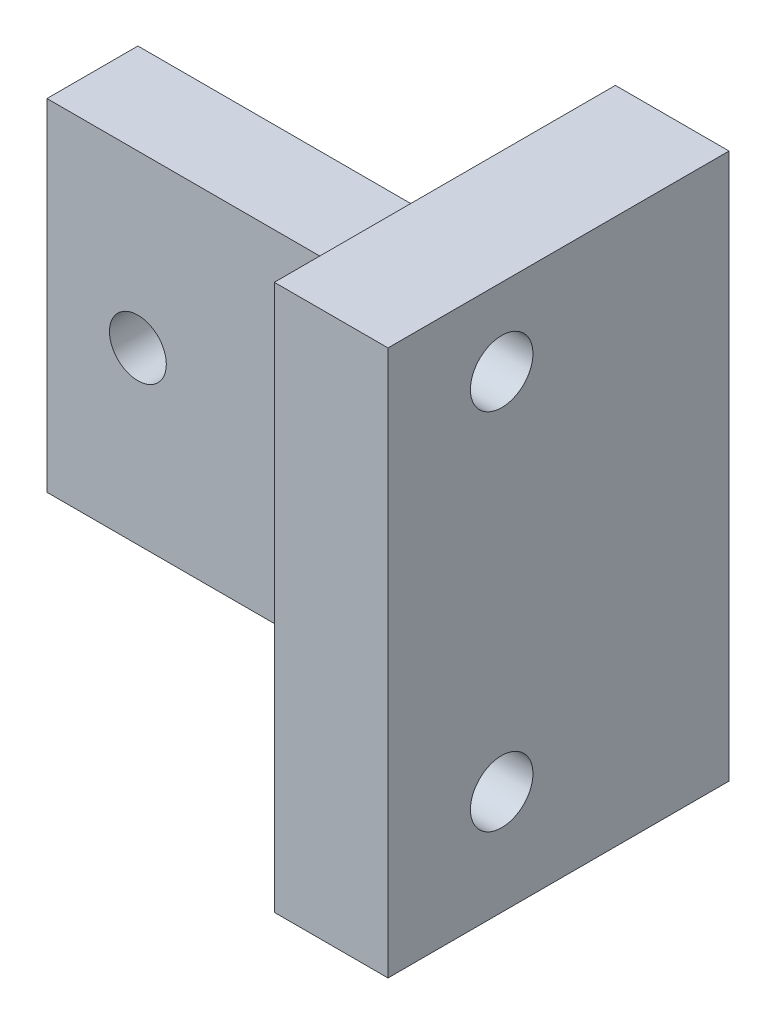
ISO-10303-21;
HEADER;
FILE_DESCRIPTION(('STEP AP214'),'2;1');
FILE_NAME('part.step','',(''),(''),'','','');
FILE_SCHEMA(('AUTOMOTIVE_DESIGN { 1 0 10303 214 1 1 1 1 }'));
ENDSEC;
DATA;
#1=APPLICATION_CONTEXT('core data for automotive mechanical design processes');
#2=APPLICATION_PROTOCOL_DEFINITION('international standard','automotive_design',2000,#1);
#3=PRODUCT_CONTEXT('',#1,'mechanical');
#4=PRODUCT('Part','Part','',(#3));
#5=PRODUCT_RELATED_PRODUCT_CATEGORY('part','',(#4));
#6=PRODUCT_DEFINITION_FORMATION('','',#4);
#7=PRODUCT_DEFINITION_CONTEXT('part definition',#1,'design');
#8=PRODUCT_DEFINITION('design','',#6,#7);
#9=PRODUCT_DEFINITION_SHAPE('','',#8);
#10=(LENGTH_UNIT() NAMED_UNIT(*) SI_UNIT(.MILLI.,.METRE.));
#11=(NAMED_UNIT(*) PLANE_ANGLE_UNIT() SI_UNIT($,.RADIAN.));
#12=(NAMED_UNIT(*) SI_UNIT($,.STERADIAN.) SOLID_ANGLE_UNIT());
#13=UNCERTAINTY_MEASURE_WITH_UNIT(LENGTH_MEASURE(1.E-05),#10,'distance_accuracy_value','');
#14=(GEOMETRIC_REPRESENTATION_CONTEXT(3) GLOBAL_UNCERTAINTY_ASSIGNED_CONTEXT((#13)) GLOBAL_UNIT_ASSIGNED_CONTEXT((#10,
#11,#12)) REPRESENTATION_CONTEXT('',''));
#15=CARTESIAN_POINT('',(0.,0.,0.));
#16=DIRECTION('',(0.,0.,1.));
#17=DIRECTION('',(1.,0.,0.));
#18=AXIS2_PLACEMENT_3D('',#15,#16,#17);
#19=CARTESIAN_POINT('',(0.,0.,0.));
#20=DIRECTION('',(0.,0.,1.));
#21=DIRECTION('',(1.,0.,0.));
#22=AXIS2_PLACEMENT_3D('',#19,#20,#21);
#23=PLANE('',#22);
#24=CARTESIAN_POINT('',(7.99999999999999,15.,0.));
#25=DIRECTION('',(0.,0.,1.));
#26=DIRECTION('',(1.,0.,0.));
#27=AXIS2_PLACEMENT_3D('',#24,#25,#26);
#28=CIRCLE('',#27,2.5);
#29=CARTESIAN_POINT('',(10.5,15.,0.));
#30=VERTEX_POINT('',#29);
#31=EDGE_CURVE('E198',#30,#30,#28,.F.);
#32=ORIENTED_EDGE('',*,*,#31,.F.);
#33=EDGE_LOOP('',(#32));
#34=FACE_BOUND('',#33,.T.);
#35=CARTESIAN_POINT('',(34.,15.,0.));
#36=DIRECTION('',(0.,0.,1.));
#37=DIRECTION('',(1.,0.,0.));
#38=AXIS2_PLACEMENT_3D('',#35,#36,#37);
#39=CIRCLE('',#38,2.5);
#40=CARTESIAN_POINT('',(36.5,15.,0.));
#41=VERTEX_POINT('',#40);
#42=EDGE_CURVE('E167',#41,#41,#39,.F.);
#43=ORIENTED_EDGE('',*,*,#42,.F.);
#44=EDGE_LOOP('',(#43));
#45=FACE_BOUND('',#44,.T.);
#46=DIRECTION('',(0.,1.,0.));
#47=VECTOR('',#46,1.);
#48=CARTESIAN_POINT('',(42.,0.,0.));
#49=LINE('',#48,#47);
#50=CARTESIAN_POINT('',(42.,30.,0.));
#51=VERTEX_POINT('',#50);
#52=CARTESIAN_POINT('',(42.,48.,0.));
#53=VERTEX_POINT('',#52);
#54=EDGE_CURVE('E136',#51,#53,#49,.T.);
#55=ORIENTED_EDGE('',*,*,#54,.T.);
#56=DIRECTION('',(1.,0.,0.));
#57=VECTOR('',#56,1.);
#58=CARTESIAN_POINT('',(0.,48.,0.));
#59=LINE('',#58,#57);
#60=CARTESIAN_POINT('',(52.,48.,0.));
#61=VERTEX_POINT('',#60);
#62=EDGE_CURVE('E125',#53,#61,#59,.T.);
#63=ORIENTED_EDGE('',*,*,#62,.T.);
#64=DIRECTION('',(0.,1.,0.));
#65=VECTOR('',#64,1.);
#66=CARTESIAN_POINT('',(52.,0.,0.));
#67=LINE('',#66,#65);
#68=CARTESIAN_POINT('',(52.,0.,0.));
#69=VERTEX_POINT('',#68);
#70=EDGE_CURVE('E75',#69,#61,#67,.T.);
#71=ORIENTED_EDGE('',*,*,#70,.F.);
#72=DIRECTION('',(1.,0.,0.));
#73=VECTOR('',#72,1.);
#74=CARTESIAN_POINT('',(0.,0.,0.));
#75=LINE('',#74,#73);
#76=CARTESIAN_POINT('',(0.,0.,0.));
#77=VERTEX_POINT('',#76);
#78=EDGE_CURVE('E101',#77,#69,#75,.T.);
#79=ORIENTED_EDGE('',*,*,#78,.F.);
#80=DIRECTION('',(0.,1.,0.));
#81=VECTOR('',#80,1.);
#82=CARTESIAN_POINT('',(0.,0.,0.));
#83=LINE('',#82,#81);
#84=CARTESIAN_POINT('',(0.,30.,0.));
#85=VERTEX_POINT('',#84);
#86=EDGE_CURVE('E164',#77,#85,#83,.T.);
#87=ORIENTED_EDGE('',*,*,#86,.T.);
#88=DIRECTION('',(1.,0.,0.));
#89=VECTOR('',#88,1.);
#90=CARTESIAN_POINT('',(0.,30.,0.));
#91=LINE('',#90,#89);
#92=EDGE_CURVE('E163',#85,#51,#91,.T.);
#93=ORIENTED_EDGE('',*,*,#92,.T.);
#94=EDGE_LOOP('',(#55,#63,#71,#79,#87,#93));
#95=FACE_BOUND('',#94,.T.);
#96=ADVANCED_FACE('F40',(#34,#45,#95),#23,.F.);
#97=CARTESIAN_POINT('',(42.,0.,30.));
#98=DIRECTION('',(-1.,0.,0.));
#99=DIRECTION('',(0.,-1.,0.));
#100=AXIS2_PLACEMENT_3D('',#97,#98,#99);
#101=PLANE('',#100);
#102=DIRECTION('',(0.,0.,1.));
#103=VECTOR('',#102,1.);
#104=CARTESIAN_POINT('',(42.,48.,30.));
#105=LINE('',#104,#103);
#106=CARTESIAN_POINT('',(42.,48.,30.));
#107=VERTEX_POINT('',#106);
#108=EDGE_CURVE('E54',#53,#107,#105,.T.);
#109=ORIENTED_EDGE('',*,*,#108,.F.);
#110=ORIENTED_EDGE('',*,*,#54,.F.);
#111=DIRECTION('',(0.,0.,-1.));
#112=VECTOR('',#111,1.);
#113=CARTESIAN_POINT('',(42.,30.,8.));
#114=LINE('',#113,#112);
#115=CARTESIAN_POINT('',(42.,30.,8.));
#116=VERTEX_POINT('',#115);
#117=EDGE_CURVE('E142',#116,#51,#114,.T.);
#118=ORIENTED_EDGE('',*,*,#117,.F.);
#119=DIRECTION('',(0.,1.,0.));
#120=VECTOR('',#119,1.);
#121=CARTESIAN_POINT('',(42.,0.,8.));
#122=LINE('',#121,#120);
#123=CARTESIAN_POINT('',(42.,0.,8.));
#124=VERTEX_POINT('',#123);
#125=EDGE_CURVE('E188',#124,#116,#122,.T.);
#126=ORIENTED_EDGE('',*,*,#125,.F.);
#127=DIRECTION('',(0.,0.,-1.));
#128=VECTOR('',#127,1.);
#129=CARTESIAN_POINT('',(42.,0.,30.));
#130=LINE('',#129,#128);
#131=CARTESIAN_POINT('',(42.,0.,30.));
#132=VERTEX_POINT('',#131);
#133=EDGE_CURVE('E63',#132,#124,#130,.T.);
#134=ORIENTED_EDGE('',*,*,#133,.F.);
#135=DIRECTION('',(0.,1.,0.));
#136=VECTOR('',#135,1.);
#137=CARTESIAN_POINT('',(42.,0.,30.));
#138=LINE('',#137,#136);
#139=EDGE_CURVE('E131',#132,#107,#138,.T.);
#140=ORIENTED_EDGE('',*,*,#139,.T.);
#141=EDGE_LOOP('',(#109,#110,#118,#126,#134,#140));
#142=FACE_BOUND('',#141,.T.);
#143=CARTESIAN_POINT('',(42.,9.20000000000001,20.));
#144=DIRECTION('',(-1.,0.,0.));
#145=DIRECTION('',(0.,-1.,0.));
#146=AXIS2_PLACEMENT_3D('',#143,#144,#145);
#147=CIRCLE('',#146,2.75);
#148=CARTESIAN_POINT('',(42.,6.45000000000002,20.));
#149=VERTEX_POINT('',#148);
#150=EDGE_CURVE('E214',#149,#149,#147,.F.);
#151=ORIENTED_EDGE('',*,*,#150,.T.);
#152=EDGE_LOOP('',(#151));
#153=FACE_BOUND('',#152,.T.);
#154=CARTESIAN_POINT('',(42.,41.2,20.));
#155=DIRECTION('',(-1.,0.,0.));
#156=DIRECTION('',(0.,-1.,0.));
#157=AXIS2_PLACEMENT_3D('',#154,#155,#156);
#158=CIRCLE('',#157,2.75);
#159=CARTESIAN_POINT('',(42.,38.45,20.));
#160=VERTEX_POINT('',#159);
#161=EDGE_CURVE('E206',#160,#160,#158,.F.);
#162=ORIENTED_EDGE('',*,*,#161,.T.);
#163=EDGE_LOOP('',(#162));
#164=FACE_BOUND('',#163,.T.);
#165=ADVANCED_FACE('F154',(#142,#153,#164),#101,.T.);
#166=CARTESIAN_POINT('',(0.,0.,30.));
#167=DIRECTION('',(0.,1.,0.));
#168=DIRECTION('',(0.,0.,1.));
#169=AXIS2_PLACEMENT_3D('',#166,#167,#168);
#170=PLANE('',#169);
#171=ORIENTED_EDGE('',*,*,#78,.T.);
#172=DIRECTION('',(0.,0.,-1.));
#173=VECTOR('',#172,1.);
#174=CARTESIAN_POINT('',(52.,0.,30.));
#175=LINE('',#174,#173);
#176=CARTESIAN_POINT('',(52.,0.,30.));
#177=VERTEX_POINT('',#176);
#178=EDGE_CURVE('E48',#177,#69,#175,.T.);
#179=ORIENTED_EDGE('',*,*,#178,.F.);
#180=DIRECTION('',(1.,0.,0.));
#181=VECTOR('',#180,1.);
#182=CARTESIAN_POINT('',(0.,0.,30.));
#183=LINE('',#182,#181);
#184=EDGE_CURVE('E128',#132,#177,#183,.T.);
#185=ORIENTED_EDGE('',*,*,#184,.F.);
#186=ORIENTED_EDGE('',*,*,#133,.T.);
#187=DIRECTION('',(1.,0.,0.));
#188=VECTOR('',#187,1.);
#189=CARTESIAN_POINT('',(0.,0.,8.));
#190=LINE('',#189,#188);
#191=CARTESIAN_POINT('',(0.,0.,8.));
#192=VERTEX_POINT('',#191);
#193=EDGE_CURVE('E107',#192,#124,#190,.T.);
#194=ORIENTED_EDGE('',*,*,#193,.F.);
#195=DIRECTION('',(0.,0.,-1.));
#196=VECTOR('',#195,1.);
#197=CARTESIAN_POINT('',(0.,0.,8.));
#198=LINE('',#197,#196);
#199=EDGE_CURVE('E84',#192,#77,#198,.T.);
#200=ORIENTED_EDGE('',*,*,#199,.T.);
#201=EDGE_LOOP('',(#171,#179,#185,#186,#194,#200));
#202=FACE_BOUND('',#201,.T.);
#203=ADVANCED_FACE('F153',(#202),#170,.F.);
#204=CARTESIAN_POINT('',(52.,0.,30.));
#205=DIRECTION('',(-1.,0.,0.));
#206=DIRECTION('',(0.,0.,1.));
#207=AXIS2_PLACEMENT_3D('',#204,#205,#206);
#208=PLANE('',#207);
#209=CARTESIAN_POINT('',(52.,9.20000000000001,20.));
#210=DIRECTION('',(1.,0.,0.));
#211=DIRECTION('',(0.,0.,1.));
#212=AXIS2_PLACEMENT_3D('',#209,#210,#211);
#213=CIRCLE('',#212,2.75);
#214=CARTESIAN_POINT('',(52.,9.20000000000001,22.75));
#215=VERTEX_POINT('',#214);
#216=EDGE_CURVE('E159',#215,#215,#213,.T.);
#217=ORIENTED_EDGE('',*,*,#216,.F.);
#218=EDGE_LOOP('',(#217));
#219=FACE_BOUND('',#218,.T.);
#220=CARTESIAN_POINT('',(52.,41.2,20.));
#221=DIRECTION('',(1.,0.,0.));
#222=DIRECTION('',(0.,0.,1.));
#223=AXIS2_PLACEMENT_3D('',#220,#221,#222);
#224=CIRCLE('',#223,2.75);
#225=CARTESIAN_POINT('',(52.,41.2,22.75));
#226=VERTEX_POINT('',#225);
#227=EDGE_CURVE('E210',#226,#226,#224,.T.);
#228=ORIENTED_EDGE('',*,*,#227,.F.);
#229=EDGE_LOOP('',(#228));
#230=FACE_BOUND('',#229,.T.);
#231=ORIENTED_EDGE('',*,*,#70,.T.);
#232=DIRECTION('',(0.,0.,-1.));
#233=VECTOR('',#232,1.);
#234=CARTESIAN_POINT('',(52.,48.,0.));
#235=LINE('',#234,#233);
#236=CARTESIAN_POINT('',(52.,48.,30.));
#237=VERTEX_POINT('',#236);
#238=EDGE_CURVE('E116',#237,#61,#235,.T.);
#239=ORIENTED_EDGE('',*,*,#238,.F.);
#240=DIRECTION('',(0.,1.,0.));
#241=VECTOR('',#240,1.);
#242=CARTESIAN_POINT('',(52.,0.,30.));
#243=LINE('',#242,#241);
#244=EDGE_CURVE('E122',#177,#237,#243,.T.);
#245=ORIENTED_EDGE('',*,*,#244,.F.);
#246=ORIENTED_EDGE('',*,*,#178,.T.);
#247=EDGE_LOOP('',(#231,#239,#245,#246));
#248=FACE_BOUND('',#247,.T.);
#249=ADVANCED_FACE('F121',(#219,#230,#248),#208,.F.);
#250=CARTESIAN_POINT('',(0.,0.,30.));
#251=DIRECTION('',(0.,0.,1.));
#252=DIRECTION('',(1.,0.,0.));
#253=AXIS2_PLACEMENT_3D('',#250,#251,#252);
#254=PLANE('',#253);
#255=DIRECTION('',(1.,0.,0.));
#256=VECTOR('',#255,1.);
#257=CARTESIAN_POINT('',(0.,48.,30.));
#258=LINE('',#257,#256);
#259=EDGE_CURVE('E11',#107,#237,#258,.T.);
#260=ORIENTED_EDGE('',*,*,#259,.F.);
#261=ORIENTED_EDGE('',*,*,#139,.F.);
#262=ORIENTED_EDGE('',*,*,#184,.T.);
#263=ORIENTED_EDGE('',*,*,#244,.T.);
#264=EDGE_LOOP('',(#260,#261,#262,#263));
#265=FACE_BOUND('',#264,.T.);
#266=ADVANCED_FACE('F127',(#265),#254,.T.);
#267=CARTESIAN_POINT('',(0.,30.,8.));
#268=DIRECTION('',(0.,1.,0.));
#269=DIRECTION('',(0.,0.,1.));
#270=AXIS2_PLACEMENT_3D('',#267,#268,#269);
#271=PLANE('',#270);
#272=ORIENTED_EDGE('',*,*,#92,.F.);
#273=DIRECTION('',(0.,0.,-1.));
#274=VECTOR('',#273,1.);
#275=CARTESIAN_POINT('',(0.,30.,8.));
#276=LINE('',#275,#274);
#277=CARTESIAN_POINT('',(0.,30.,8.));
#278=VERTEX_POINT('',#277);
#279=EDGE_CURVE('E181',#278,#85,#276,.T.);
#280=ORIENTED_EDGE('',*,*,#279,.F.);
#281=DIRECTION('',(1.,0.,0.));
#282=VECTOR('',#281,1.);
#283=CARTESIAN_POINT('',(0.,30.,8.));
#284=LINE('',#283,#282);
#285=EDGE_CURVE('E187',#278,#116,#284,.T.);
#286=ORIENTED_EDGE('',*,*,#285,.T.);
#287=ORIENTED_EDGE('',*,*,#117,.T.);
#288=EDGE_LOOP('',(#272,#280,#286,#287));
#289=FACE_BOUND('',#288,.T.);
#290=ADVANCED_FACE('F185',(#289),#271,.T.);
#291=CARTESIAN_POINT('',(0.,0.,8.));
#292=DIRECTION('',(-1.,0.,0.));
#293=DIRECTION('',(0.,0.,1.));
#294=AXIS2_PLACEMENT_3D('',#291,#292,#293);
#295=PLANE('',#294);
#296=ORIENTED_EDGE('',*,*,#86,.F.);
#297=ORIENTED_EDGE('',*,*,#199,.F.);
#298=DIRECTION('',(0.,1.,0.));
#299=VECTOR('',#298,1.);
#300=CARTESIAN_POINT('',(0.,0.,8.));
#301=LINE('',#300,#299);
#302=EDGE_CURVE('E176',#192,#278,#301,.T.);
#303=ORIENTED_EDGE('',*,*,#302,.T.);
#304=ORIENTED_EDGE('',*,*,#279,.T.);
#305=EDGE_LOOP('',(#296,#297,#303,#304));
#306=FACE_BOUND('',#305,.T.);
#307=ADVANCED_FACE('F251',(#306),#295,.T.);
#308=CARTESIAN_POINT('',(0.,0.,8.));
#309=DIRECTION('',(0.,0.,1.));
#310=DIRECTION('',(1.,0.,0.));
#311=AXIS2_PLACEMENT_3D('',#308,#309,#310);
#312=PLANE('',#311);
#313=CARTESIAN_POINT('',(7.99999999999999,15.,8.));
#314=DIRECTION('',(0.,0.,1.));
#315=DIRECTION('',(-1.,0.,0.));
#316=AXIS2_PLACEMENT_3D('',#313,#314,#315);
#317=CIRCLE('',#316,2.5);
#318=CARTESIAN_POINT('',(5.49999999999999,15.,8.));
#319=VERTEX_POINT('',#318);
#320=EDGE_CURVE('E202',#319,#319,#317,.T.);
#321=ORIENTED_EDGE('',*,*,#320,.F.);
#322=EDGE_LOOP('',(#321));
#323=FACE_BOUND('',#322,.T.);
#324=CARTESIAN_POINT('',(34.,15.,8.));
#325=DIRECTION('',(0.,0.,1.));
#326=DIRECTION('',(-1.,0.,0.));
#327=AXIS2_PLACEMENT_3D('',#324,#325,#326);
#328=CIRCLE('',#327,2.5);
#329=CARTESIAN_POINT('',(31.5,15.,8.));
#330=VERTEX_POINT('',#329);
#331=EDGE_CURVE('E173',#330,#330,#328,.T.);
#332=ORIENTED_EDGE('',*,*,#331,.F.);
#333=EDGE_LOOP('',(#332));
#334=FACE_BOUND('',#333,.T.);
#335=ORIENTED_EDGE('',*,*,#193,.T.);
#336=ORIENTED_EDGE('',*,*,#125,.T.);
#337=ORIENTED_EDGE('',*,*,#285,.F.);
#338=ORIENTED_EDGE('',*,*,#302,.F.);
#339=EDGE_LOOP('',(#335,#336,#337,#338));
#340=FACE_BOUND('',#339,.T.);
#341=ADVANCED_FACE('F254',(#323,#334,#340),#312,.T.);
#342=CARTESIAN_POINT('',(34.,15.,-7.07106781186548));
#343=DIRECTION('',(0.,0.,1.));
#344=DIRECTION('',(1.,0.,0.));
#345=AXIS2_PLACEMENT_3D('',#342,#343,#344);
#346=CYLINDRICAL_SURFACE('',#345,2.5);
#347=ORIENTED_EDGE('',*,*,#42,.T.);
#348=EDGE_LOOP('',(#347));
#349=FACE_BOUND('',#348,.T.);
#350=ORIENTED_EDGE('',*,*,#331,.T.);
#351=EDGE_LOOP('',(#350));
#352=FACE_BOUND('',#351,.T.);
#353=ADVANCED_FACE('F257',(#349,#352),#346,.F.);
#354=CARTESIAN_POINT('',(7.99999999999999,15.,-7.07106781186548));
#355=DIRECTION('',(0.,0.,1.));
#356=DIRECTION('',(1.,0.,0.));
#357=AXIS2_PLACEMENT_3D('',#354,#355,#356);
#358=CYLINDRICAL_SURFACE('',#357,2.5);
#359=ORIENTED_EDGE('',*,*,#31,.T.);
#360=EDGE_LOOP('',(#359));
#361=FACE_BOUND('',#360,.T.);
#362=ORIENTED_EDGE('',*,*,#320,.T.);
#363=EDGE_LOOP('',(#362));
#364=FACE_BOUND('',#363,.T.);
#365=ADVANCED_FACE('F235',(#361,#364),#358,.F.);
#366=CARTESIAN_POINT('',(34.221825406948,41.2,20.));
#367=DIRECTION('',(1.,0.,0.));
#368=DIRECTION('',(0.,0.,-1.));
#369=AXIS2_PLACEMENT_3D('',#366,#367,#368);
#370=CYLINDRICAL_SURFACE('',#369,2.75);
#371=ORIENTED_EDGE('',*,*,#227,.T.);
#372=EDGE_LOOP('',(#371));
#373=FACE_BOUND('',#372,.T.);
#374=ORIENTED_EDGE('',*,*,#161,.F.);
#375=EDGE_LOOP('',(#374));
#376=FACE_BOUND('',#375,.T.);
#377=ADVANCED_FACE('F232',(#373,#376),#370,.F.);
#378=CARTESIAN_POINT('',(34.221825406948,9.20000000000001,20.));
#379=DIRECTION('',(1.,0.,0.));
#380=DIRECTION('',(0.,0.,-1.));
#381=AXIS2_PLACEMENT_3D('',#378,#379,#380);
#382=CYLINDRICAL_SURFACE('',#381,2.75);
#383=ORIENTED_EDGE('',*,*,#216,.T.);
#384=EDGE_LOOP('',(#383));
#385=FACE_BOUND('',#384,.T.);
#386=ORIENTED_EDGE('',*,*,#150,.F.);
#387=EDGE_LOOP('',(#386));
#388=FACE_BOUND('',#387,.T.);
#389=ADVANCED_FACE('F224',(#385,#388),#382,.F.);
#390=CARTESIAN_POINT('',(0.,48.,0.));
#391=DIRECTION('',(0.,-1.,0.));
#392=DIRECTION('',(0.,0.,-1.));
#393=AXIS2_PLACEMENT_3D('',#390,#391,#392);
#394=PLANE('',#393);
#395=ORIENTED_EDGE('',*,*,#108,.T.);
#396=ORIENTED_EDGE('',*,*,#259,.T.);
#397=ORIENTED_EDGE('',*,*,#238,.T.);
#398=ORIENTED_EDGE('',*,*,#62,.F.);
#399=EDGE_LOOP('',(#395,#396,#397,#398));
#400=FACE_BOUND('',#399,.T.);
#401=ADVANCED_FACE('F115',(#400),#394,.F.);
#402=CLOSED_SHELL('',(#96,#165,#203,#249,#266,#290,#307,#341,#353,#365,#377,#389,#401));
#403=MANIFOLD_SOLID_BREP('B2',#402);
#404=ADVANCED_BREP_SHAPE_REPRESENTATION('',(#18,#403),#14);
#405=SHAPE_DEFINITION_REPRESENTATION(#9,#404);
ENDSEC;
END-ISO-10303-21;
